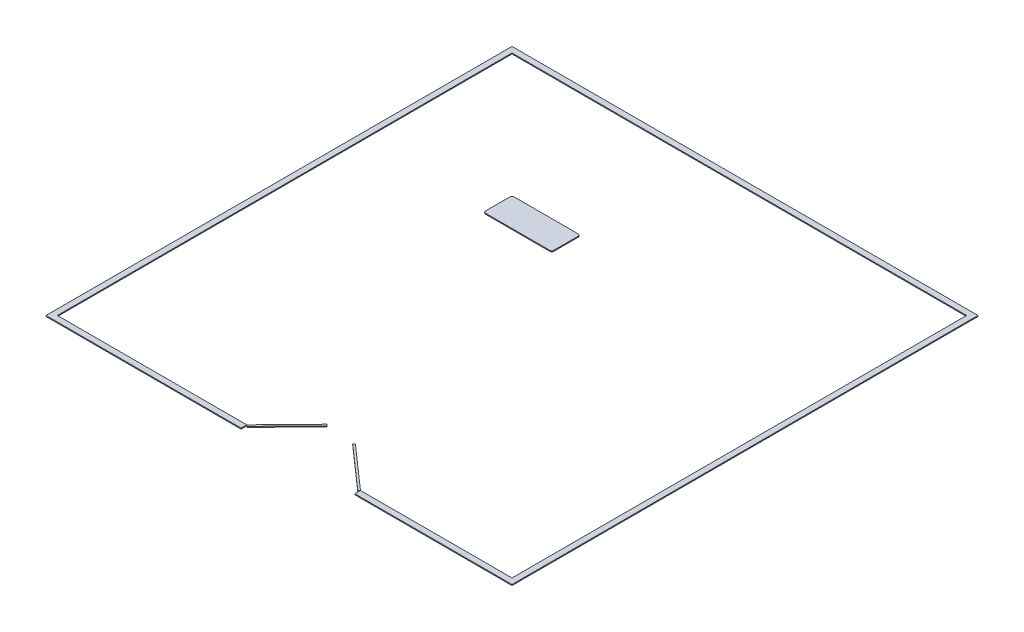
ISO-10303-21;
HEADER;
FILE_DESCRIPTION(('STEP AP214'),'2;1');
FILE_NAME('part.step','',(''),(''),'','','');
FILE_SCHEMA(('AUTOMOTIVE_DESIGN { 1 0 10303 214 1 1 1 1 }'));
ENDSEC;
DATA;
#1=APPLICATION_CONTEXT('core data for automotive mechanical design processes');
#2=APPLICATION_PROTOCOL_DEFINITION('international standard','automotive_design',2000,#1);
#3=PRODUCT_CONTEXT('',#1,'mechanical');
#4=PRODUCT('Part','Part','',(#3));
#5=PRODUCT_RELATED_PRODUCT_CATEGORY('part','',(#4));
#6=PRODUCT_DEFINITION_FORMATION('','',#4);
#7=PRODUCT_DEFINITION_CONTEXT('part definition',#1,'design');
#8=PRODUCT_DEFINITION('design','',#6,#7);
#9=PRODUCT_DEFINITION_SHAPE('','',#8);
#10=(LENGTH_UNIT() NAMED_UNIT(*) SI_UNIT(.MILLI.,.METRE.));
#11=(NAMED_UNIT(*) PLANE_ANGLE_UNIT() SI_UNIT($,.RADIAN.));
#12=(NAMED_UNIT(*) SI_UNIT($,.STERADIAN.) SOLID_ANGLE_UNIT());
#13=UNCERTAINTY_MEASURE_WITH_UNIT(LENGTH_MEASURE(1.E-05),#10,'distance_accuracy_value','');
#14=(GEOMETRIC_REPRESENTATION_CONTEXT(3) GLOBAL_UNCERTAINTY_ASSIGNED_CONTEXT((#13)) GLOBAL_UNIT_ASSIGNED_CONTEXT((#10,
#11,#12)) REPRESENTATION_CONTEXT('',''));
#15=CARTESIAN_POINT('',(0.,0.,0.));
#16=DIRECTION('',(0.,0.,1.));
#17=DIRECTION('',(1.,0.,0.));
#18=AXIS2_PLACEMENT_3D('',#15,#16,#17);
#19=CARTESIAN_POINT('',(8091.38785926303,25.4,35.4452196999511));
#20=DIRECTION('',(-0.695564454896768,0.,-0.718463700603003));
#21=DIRECTION('',(-0.718463700603003,0.,0.695564454896768));
#22=AXIS2_PLACEMENT_3D('',#19,#20,#21);
#23=PLANE('',#22);
#24=DIRECTION('',(0.718463700603003,0.,-0.695564454896768));
#25=VECTOR('',#24,1.);
#26=CARTESIAN_POINT('',(8091.38785926303,0.,35.4452196999511));
#27=LINE('',#26,#25);
#28=CARTESIAN_POINT('',(8091.38785926303,0.,35.4452196999511));
#29=VERTEX_POINT('',#28);
#30=CARTESIAN_POINT('',(8128.,0.,0.));
#31=VERTEX_POINT('',#30);
#32=EDGE_CURVE('E112',#29,#31,#27,.T.);
#33=ORIENTED_EDGE('',*,*,#32,.T.);
#34=DIRECTION('',(0.,-1.,0.));
#35=VECTOR('',#34,1.);
#36=CARTESIAN_POINT('',(8128.,25.4,0.));
#37=LINE('',#36,#35);
#38=CARTESIAN_POINT('',(8128.,25.4,0.));
#39=VERTEX_POINT('',#38);
#40=EDGE_CURVE('E12',#39,#31,#37,.T.);
#41=ORIENTED_EDGE('',*,*,#40,.F.);
#42=DIRECTION('',(0.718463700603003,0.,-0.695564454896768));
#43=VECTOR('',#42,1.);
#44=CARTESIAN_POINT('',(8091.38785926303,25.4,35.4452196999511));
#45=LINE('',#44,#43);
#46=CARTESIAN_POINT('',(8091.38785926303,25.4,35.4452196999511));
#47=VERTEX_POINT('',#46);
#48=EDGE_CURVE('E100',#47,#39,#45,.T.);
#49=ORIENTED_EDGE('',*,*,#48,.F.);
#50=DIRECTION('',(0.,-1.,0.));
#51=VECTOR('',#50,1.);
#52=CARTESIAN_POINT('',(8091.38785926303,25.4,35.4452196999511));
#53=LINE('',#52,#51);
#54=EDGE_CURVE('E108',#47,#29,#53,.T.);
#55=ORIENTED_EDGE('',*,*,#54,.T.);
#56=EDGE_LOOP('',(#33,#41,#49,#55));
#57=FACE_BOUND('',#56,.T.);
#58=ADVANCED_FACE('F49',(#57),#23,.F.);
#59=CARTESIAN_POINT('',(8128.,25.4,0.));
#60=DIRECTION('',(-0.661331494257193,0.,0.750093763941248));
#61=DIRECTION('',(0.750093763941248,0.,0.661331494257193));
#62=AXIS2_PLACEMENT_3D('',#59,#60,#61);
#63=PLANE('',#62);
#64=DIRECTION('',(-0.750093763941248,0.,-0.661331494257193));
#65=VECTOR('',#64,1.);
#66=CARTESIAN_POINT('',(8128.,0.,0.));
#67=LINE('',#66,#65);
#68=CARTESIAN_POINT('',(6984.85710375354,0.,-1007.86919724796));
#69=VERTEX_POINT('',#68);
#70=EDGE_CURVE('E104',#31,#69,#67,.T.);
#71=ORIENTED_EDGE('',*,*,#70,.T.);
#72=DIRECTION('',(0.,-1.,0.));
#73=VECTOR('',#72,1.);
#74=CARTESIAN_POINT('',(6984.85710375354,25.4,-1007.86919724796));
#75=LINE('',#74,#73);
#76=CARTESIAN_POINT('',(6984.85710375354,25.4,-1007.86919724796));
#77=VERTEX_POINT('',#76);
#78=EDGE_CURVE('E57',#77,#69,#75,.T.);
#79=ORIENTED_EDGE('',*,*,#78,.F.);
#80=DIRECTION('',(-0.750093763941248,0.,-0.661331494257193));
#81=VECTOR('',#80,1.);
#82=CARTESIAN_POINT('',(8128.,25.4,0.));
#83=LINE('',#82,#81);
#84=EDGE_CURVE('E95',#39,#77,#83,.T.);
#85=ORIENTED_EDGE('',*,*,#84,.F.);
#86=ORIENTED_EDGE('',*,*,#40,.T.);
#87=EDGE_LOOP('',(#71,#79,#85,#86));
#88=FACE_BOUND('',#87,.T.);
#89=ADVANCED_FACE('F103',(#88),#63,.F.);
#90=CARTESIAN_POINT('',(6984.85710375354,25.4,-1007.86919724796));
#91=DIRECTION('',(0.75009376394125,0.,0.66133149425719));
#92=DIRECTION('',(0.66133149425719,0.,-0.75009376394125));
#93=AXIS2_PLACEMENT_3D('',#90,#91,#92);
#94=PLANE('',#93);
#95=DIRECTION('',(-0.66133149425719,0.,0.75009376394125));
#96=VECTOR('',#95,1.);
#97=CARTESIAN_POINT('',(6984.85710375354,0.,-1007.86919724796));
#98=LINE('',#97,#96);
#99=CARTESIAN_POINT('',(6951.26146384527,0.,-969.764434039747));
#100=VERTEX_POINT('',#99);
#101=EDGE_CURVE('E82',#69,#100,#98,.T.);
#102=ORIENTED_EDGE('',*,*,#101,.T.);
#103=DIRECTION('',(0.,-1.,0.));
#104=VECTOR('',#103,1.);
#105=CARTESIAN_POINT('',(6951.26146384527,25.4,-969.764434039747));
#106=LINE('',#105,#104);
#107=CARTESIAN_POINT('',(6951.26146384527,25.4,-969.764434039747));
#108=VERTEX_POINT('',#107);
#109=EDGE_CURVE('E105',#108,#100,#106,.T.);
#110=ORIENTED_EDGE('',*,*,#109,.F.);
#111=DIRECTION('',(-0.66133149425719,0.,0.75009376394125));
#112=VECTOR('',#111,1.);
#113=CARTESIAN_POINT('',(6984.85710375354,25.4,-1007.86919724796));
#114=LINE('',#113,#112);
#115=EDGE_CURVE('E98',#77,#108,#114,.T.);
#116=ORIENTED_EDGE('',*,*,#115,.F.);
#117=ORIENTED_EDGE('',*,*,#78,.T.);
#118=EDGE_LOOP('',(#102,#110,#116,#117));
#119=FACE_BOUND('',#118,.T.);
#120=ADVANCED_FACE('F106',(#119),#94,.F.);
#121=CARTESIAN_POINT('',(6951.26146384527,25.4,-969.764434039747));
#122=DIRECTION('',(0.66133149425719,0.,-0.75009376394125));
#123=DIRECTION('',(-0.75009376394125,0.,-0.66133149425719));
#124=AXIS2_PLACEMENT_3D('',#121,#122,#123);
#125=PLANE('',#124);
#126=DIRECTION('',(0.75009376394125,0.,0.66133149425719));
#127=VECTOR('',#126,1.);
#128=CARTESIAN_POINT('',(6951.26146384527,0.,-969.764434039747));
#129=LINE('',#128,#127);
#130=EDGE_CURVE('E88',#100,#29,#129,.T.);
#131=ORIENTED_EDGE('',*,*,#130,.T.);
#132=ORIENTED_EDGE('',*,*,#54,.F.);
#133=DIRECTION('',(0.75009376394125,0.,0.66133149425719));
#134=VECTOR('',#133,1.);
#135=CARTESIAN_POINT('',(6951.26146384527,25.4,-969.764434039747));
#136=LINE('',#135,#134);
#137=EDGE_CURVE('E65',#108,#47,#136,.T.);
#138=ORIENTED_EDGE('',*,*,#137,.F.);
#139=ORIENTED_EDGE('',*,*,#109,.T.);
#140=EDGE_LOOP('',(#131,#132,#138,#139));
#141=FACE_BOUND('',#140,.T.);
#142=ADVANCED_FACE('F119',(#141),#125,.F.);
#143=CARTESIAN_POINT('',(0.,25.4,0.));
#144=DIRECTION('',(0.,1.,0.));
#145=DIRECTION('',(0.,0.,1.));
#146=AXIS2_PLACEMENT_3D('',#143,#144,#145);
#147=PLANE('',#146);
#148=ORIENTED_EDGE('',*,*,#48,.T.);
#149=ORIENTED_EDGE('',*,*,#84,.T.);
#150=ORIENTED_EDGE('',*,*,#115,.T.);
#151=ORIENTED_EDGE('',*,*,#137,.T.);
#152=EDGE_LOOP('',(#148,#149,#150,#151));
#153=FACE_BOUND('',#152,.T.);
#154=ADVANCED_FACE('F96',(#153),#147,.T.);
#155=CARTESIAN_POINT('',(0.,0.,0.));
#156=DIRECTION('',(0.,1.,0.));
#157=DIRECTION('',(0.,0.,1.));
#158=AXIS2_PLACEMENT_3D('',#155,#156,#157);
#159=PLANE('',#158);
#160=ORIENTED_EDGE('',*,*,#32,.F.);
#161=ORIENTED_EDGE('',*,*,#130,.F.);
#162=ORIENTED_EDGE('',*,*,#101,.F.);
#163=ORIENTED_EDGE('',*,*,#70,.F.);
#164=EDGE_LOOP('',(#160,#161,#162,#163));
#165=FACE_BOUND('',#164,.T.);
#166=ADVANCED_FACE('F122',(#165),#159,.F.);
#167=CLOSED_SHELL('',(#58,#89,#120,#142,#154,#166));
#168=MANIFOLD_SOLID_BREP('B2',#167);
#169=CARTESIAN_POINT('',(5116.39060868441,25.4,35.4452196999511));
#170=DIRECTION('',(0.697740545274679,0.,-0.716350564653783));
#171=DIRECTION('',(-0.716350564653783,0.,-0.697740545274679));
#172=AXIS2_PLACEMENT_3D('',#169,#170,#171);
#173=PLANE('',#172);
#174=DIRECTION('',(0.716350564653783,0.,0.697740545274679));
#175=VECTOR('',#174,1.);
#176=CARTESIAN_POINT('',(5116.39060868441,0.,35.4452196999511));
#177=LINE('',#176,#175);
#178=CARTESIAN_POINT('',(5080.,0.,0.));
#179=VERTEX_POINT('',#178);
#180=CARTESIAN_POINT('',(5116.39060868441,0.,35.4452196999511));
#181=VERTEX_POINT('',#180);
#182=EDGE_CURVE('E245',#179,#181,#177,.T.);
#183=ORIENTED_EDGE('',*,*,#182,.T.);
#184=DIRECTION('',(0.,-1.,0.));
#185=VECTOR('',#184,1.);
#186=CARTESIAN_POINT('',(5116.39060868441,25.4,35.4452196999511));
#187=LINE('',#186,#185);
#188=CARTESIAN_POINT('',(5116.39060868441,25.4,35.4452196999511));
#189=VERTEX_POINT('',#188);
#190=EDGE_CURVE('E47',#189,#181,#187,.T.);
#191=ORIENTED_EDGE('',*,*,#190,.F.);
#192=DIRECTION('',(0.716350564653783,0.,0.697740545274679));
#193=VECTOR('',#192,1.);
#194=CARTESIAN_POINT('',(5116.39060868441,25.4,35.4452196999511));
#195=LINE('',#194,#193);
#196=CARTESIAN_POINT('',(5080.,25.4,0.));
#197=VERTEX_POINT('',#196);
#198=EDGE_CURVE('E233',#197,#189,#195,.T.);
#199=ORIENTED_EDGE('',*,*,#198,.F.);
#200=DIRECTION('',(0.,-1.,0.));
#201=VECTOR('',#200,1.);
#202=CARTESIAN_POINT('',(5080.,25.4,0.));
#203=LINE('',#202,#201);
#204=EDGE_CURVE('E241',#197,#179,#203,.T.);
#205=ORIENTED_EDGE('',*,*,#204,.T.);
#206=EDGE_LOOP('',(#183,#191,#199,#205));
#207=FACE_BOUND('',#206,.T.);
#208=ADVANCED_FACE('F182',(#207),#173,.F.);
#209=CARTESIAN_POINT('',(6179.74719968301,25.4,-1056.27304083242));
#210=DIRECTION('',(-0.716350564653786,0.,-0.697740545274675));
#211=DIRECTION('',(-0.697740545274676,0.,0.716350564653786));
#212=AXIS2_PLACEMENT_3D('',#209,#210,#211);
#213=PLANE('',#212);
#214=DIRECTION('',(0.697740545274675,0.,-0.716350564653786));
#215=VECTOR('',#214,1.);
#216=CARTESIAN_POINT('',(6179.74719968301,0.,-1056.27304083242));
#217=LINE('',#216,#215);
#218=CARTESIAN_POINT('',(6179.74719968301,0.,-1056.27304083242));
#219=VERTEX_POINT('',#218);
#220=EDGE_CURVE('E237',#181,#219,#217,.T.);
#221=ORIENTED_EDGE('',*,*,#220,.T.);
#222=DIRECTION('',(0.,-1.,0.));
#223=VECTOR('',#222,1.);
#224=CARTESIAN_POINT('',(6179.74719968301,25.4,-1056.27304083242));
#225=LINE('',#224,#223);
#226=CARTESIAN_POINT('',(6179.74719968301,25.4,-1056.27304083242));
#227=VERTEX_POINT('',#226);
#228=EDGE_CURVE('E190',#227,#219,#225,.T.);
#229=ORIENTED_EDGE('',*,*,#228,.F.);
#230=DIRECTION('',(0.697740545274675,0.,-0.716350564653786));
#231=VECTOR('',#230,1.);
#232=CARTESIAN_POINT('',(6179.74719968301,25.4,-1056.27304083242));
#233=LINE('',#232,#231);
#234=EDGE_CURVE('E228',#189,#227,#233,.T.);
#235=ORIENTED_EDGE('',*,*,#234,.F.);
#236=ORIENTED_EDGE('',*,*,#190,.T.);
#237=EDGE_LOOP('',(#221,#229,#235,#236));
#238=FACE_BOUND('',#237,.T.);
#239=ADVANCED_FACE('F236',(#238),#213,.F.);
#240=CARTESIAN_POINT('',(6143.3565909986,25.4,-1091.71826053237));
#241=DIRECTION('',(-0.69774054527468,0.,0.716350564653782));
#242=DIRECTION('',(0.716350564653782,0.,0.69774054527468));
#243=AXIS2_PLACEMENT_3D('',#240,#241,#242);
#244=PLANE('',#243);
#245=DIRECTION('',(-0.716350564653782,0.,-0.69774054527468));
#246=VECTOR('',#245,1.);
#247=CARTESIAN_POINT('',(6143.3565909986,0.,-1091.71826053237));
#248=LINE('',#247,#246);
#249=CARTESIAN_POINT('',(6143.3565909986,0.,-1091.71826053237));
#250=VERTEX_POINT('',#249);
#251=EDGE_CURVE('E215',#219,#250,#248,.T.);
#252=ORIENTED_EDGE('',*,*,#251,.T.);
#253=DIRECTION('',(0.,-1.,0.));
#254=VECTOR('',#253,1.);
#255=CARTESIAN_POINT('',(6143.3565909986,25.4,-1091.71826053237));
#256=LINE('',#255,#254);
#257=CARTESIAN_POINT('',(6143.3565909986,25.4,-1091.71826053237));
#258=VERTEX_POINT('',#257);
#259=EDGE_CURVE('E238',#258,#250,#256,.T.);
#260=ORIENTED_EDGE('',*,*,#259,.F.);
#261=DIRECTION('',(-0.716350564653782,0.,-0.69774054527468));
#262=VECTOR('',#261,1.);
#263=CARTESIAN_POINT('',(6143.3565909986,25.4,-1091.71826053237));
#264=LINE('',#263,#262);
#265=EDGE_CURVE('E231',#227,#258,#264,.T.);
#266=ORIENTED_EDGE('',*,*,#265,.F.);
#267=ORIENTED_EDGE('',*,*,#228,.T.);
#268=EDGE_LOOP('',(#252,#260,#266,#267));
#269=FACE_BOUND('',#268,.T.);
#270=ADVANCED_FACE('F239',(#269),#244,.F.);
#271=CARTESIAN_POINT('',(5080.,25.4,0.));
#272=DIRECTION('',(0.716350564653788,0.,0.697740545274674));
#273=DIRECTION('',(0.697740545274674,0.,-0.716350564653788));
#274=AXIS2_PLACEMENT_3D('',#271,#272,#273);
#275=PLANE('',#274);
#276=DIRECTION('',(-0.697740545274674,0.,0.716350564653788));
#277=VECTOR('',#276,1.);
#278=CARTESIAN_POINT('',(5080.,0.,0.));
#279=LINE('',#278,#277);
#280=EDGE_CURVE('E221',#250,#179,#279,.T.);
#281=ORIENTED_EDGE('',*,*,#280,.T.);
#282=ORIENTED_EDGE('',*,*,#204,.F.);
#283=DIRECTION('',(-0.697740545274674,0.,0.716350564653788));
#284=VECTOR('',#283,1.);
#285=CARTESIAN_POINT('',(5080.,25.4,0.));
#286=LINE('',#285,#284);
#287=EDGE_CURVE('E198',#258,#197,#286,.T.);
#288=ORIENTED_EDGE('',*,*,#287,.F.);
#289=ORIENTED_EDGE('',*,*,#259,.T.);
#290=EDGE_LOOP('',(#281,#282,#288,#289));
#291=FACE_BOUND('',#290,.T.);
#292=ADVANCED_FACE('F252',(#291),#275,.F.);
#293=CARTESIAN_POINT('',(0.,25.4,0.));
#294=DIRECTION('',(0.,-1.,0.));
#295=DIRECTION('',(0.,0.,-1.));
#296=AXIS2_PLACEMENT_3D('',#293,#294,#295);
#297=PLANE('',#296);
#298=ORIENTED_EDGE('',*,*,#198,.T.);
#299=ORIENTED_EDGE('',*,*,#234,.T.);
#300=ORIENTED_EDGE('',*,*,#265,.T.);
#301=ORIENTED_EDGE('',*,*,#287,.T.);
#302=EDGE_LOOP('',(#298,#299,#300,#301));
#303=FACE_BOUND('',#302,.T.);
#304=ADVANCED_FACE('F229',(#303),#297,.F.);
#305=CARTESIAN_POINT('',(0.,0.,0.));
#306=DIRECTION('',(0.,-1.,0.));
#307=DIRECTION('',(0.,0.,-1.));
#308=AXIS2_PLACEMENT_3D('',#305,#306,#307);
#309=PLANE('',#308);
#310=ORIENTED_EDGE('',*,*,#182,.F.);
#311=ORIENTED_EDGE('',*,*,#280,.F.);
#312=ORIENTED_EDGE('',*,*,#251,.F.);
#313=ORIENTED_EDGE('',*,*,#220,.F.);
#314=EDGE_LOOP('',(#310,#311,#312,#313));
#315=FACE_BOUND('',#314,.T.);
#316=ADVANCED_FACE('F255',(#315),#309,.T.);
#317=CLOSED_SHELL('',(#208,#239,#270,#292,#304,#316));
#318=MANIFOLD_SOLID_BREP('B6',#317);
#319=CARTESIAN_POINT('',(5092.25506006705,25.4,-8166.45950436732));
#320=DIRECTION('',(0.,-1.,0.));
#321=DIRECTION('',(0.,0.,-1.));
#322=AXIS2_PLACEMENT_3D('',#319,#320,#321);
#323=CYLINDRICAL_SURFACE('',#322,50.8000000000002);
#324=CARTESIAN_POINT('',(5092.25506006705,0.,-8166.45950436732));
#325=DIRECTION('',(0.,1.,0.));
#326=DIRECTION('',(0.,0.,1.));
#327=AXIS2_PLACEMENT_3D('',#324,#325,#326);
#328=CIRCLE('',#327,50.8000000000002);
#329=CARTESIAN_POINT('',(5092.25506006705,0.,-8115.65950436732));
#330=VERTEX_POINT('',#329);
#331=CARTESIAN_POINT('',(5143.05506006705,0.,-8166.45950436732));
#332=VERTEX_POINT('',#331);
#333=EDGE_CURVE('E410',#330,#332,#328,.T.);
#334=ORIENTED_EDGE('',*,*,#333,.T.);
#335=DIRECTION('',(0.,-1.,0.));
#336=VECTOR('',#335,1.);
#337=CARTESIAN_POINT('',(5143.05506006705,25.4,-8166.45950436732));
#338=LINE('',#337,#336);
#339=CARTESIAN_POINT('',(5143.05506006705,25.4,-8166.45950436732));
#340=VERTEX_POINT('',#339);
#341=EDGE_CURVE('E180',#340,#332,#338,.T.);
#342=ORIENTED_EDGE('',*,*,#341,.F.);
#343=CARTESIAN_POINT('',(5092.25506006705,25.4,-8166.45950436732));
#344=DIRECTION('',(0.,1.,0.));
#345=DIRECTION('',(0.,0.,1.));
#346=AXIS2_PLACEMENT_3D('',#343,#344,#345);
#347=CIRCLE('',#346,50.8000000000002);
#348=CARTESIAN_POINT('',(5092.25506006705,25.4,-8115.65950436732));
#349=VERTEX_POINT('',#348);
#350=EDGE_CURVE('E424',#349,#340,#347,.T.);
#351=ORIENTED_EDGE('',*,*,#350,.F.);
#352=DIRECTION('',(0.,-1.,0.));
#353=VECTOR('',#352,1.);
#354=CARTESIAN_POINT('',(5092.25506006705,25.4,-8115.65950436732));
#355=LINE('',#354,#353);
#356=EDGE_CURVE('E406',#349,#330,#355,.T.);
#357=ORIENTED_EDGE('',*,*,#356,.T.);
#358=EDGE_LOOP('',(#334,#342,#351,#357));
#359=FACE_BOUND('',#358,.T.);
#360=ADVANCED_FACE('F314',(#359),#323,.T.);
#361=CARTESIAN_POINT('',(5143.05506006705,25.4,-8826.85950436732));
#362=DIRECTION('',(-1.,0.,0.));
#363=DIRECTION('',(0.,0.,1.));
#364=AXIS2_PLACEMENT_3D('',#361,#362,#363);
#365=PLANE('',#364);
#366=DIRECTION('',(0.,0.,-1.));
#367=VECTOR('',#366,1.);
#368=CARTESIAN_POINT('',(5143.05506006705,0.,-8826.85950436732));
#369=LINE('',#368,#367);
#370=CARTESIAN_POINT('',(5143.05506006705,0.,-8826.85950436732));
#371=VERTEX_POINT('',#370);
#372=EDGE_CURVE('E413',#332,#371,#369,.T.);
#373=ORIENTED_EDGE('',*,*,#372,.T.);
#374=DIRECTION('',(0.,-1.,0.));
#375=VECTOR('',#374,1.);
#376=CARTESIAN_POINT('',(5143.05506006705,25.4,-8826.85950436732));
#377=LINE('',#376,#375);
#378=CARTESIAN_POINT('',(5143.05506006705,25.4,-8826.85950436732));
#379=VERTEX_POINT('',#378);
#380=EDGE_CURVE('E322',#379,#371,#377,.T.);
#381=ORIENTED_EDGE('',*,*,#380,.F.);
#382=DIRECTION('',(0.,0.,-1.));
#383=VECTOR('',#382,1.);
#384=CARTESIAN_POINT('',(5143.05506006705,25.4,-8826.85950436732));
#385=LINE('',#384,#383);
#386=EDGE_CURVE('E373',#340,#379,#385,.T.);
#387=ORIENTED_EDGE('',*,*,#386,.F.);
#388=ORIENTED_EDGE('',*,*,#341,.T.);
#389=EDGE_LOOP('',(#373,#381,#387,#388));
#390=FACE_BOUND('',#389,.T.);
#391=ADVANCED_FACE('F459',(#390),#365,.F.);
#392=CARTESIAN_POINT('',(5092.25506006705,25.4,-8826.85950436732));
#393=DIRECTION('',(0.,-1.,0.));
#394=DIRECTION('',(0.,0.,-1.));
#395=AXIS2_PLACEMENT_3D('',#392,#393,#394);
#396=CYLINDRICAL_SURFACE('',#395,50.8000000000002);
#397=CARTESIAN_POINT('',(5092.25506006705,0.,-8826.85950436732));
#398=DIRECTION('',(0.,1.,0.));
#399=DIRECTION('',(0.,0.,-1.));
#400=AXIS2_PLACEMENT_3D('',#397,#398,#399);
#401=CIRCLE('',#400,50.8000000000002);
#402=CARTESIAN_POINT('',(5092.25506006705,0.,-8877.65950436732));
#403=VERTEX_POINT('',#402);
#404=EDGE_CURVE('E415',#371,#403,#401,.T.);
#405=ORIENTED_EDGE('',*,*,#404,.T.);
#406=DIRECTION('',(0.,-1.,0.));
#407=VECTOR('',#406,1.);
#408=CARTESIAN_POINT('',(5092.25506006705,25.4,-8877.65950436732));
#409=LINE('',#408,#407);
#410=CARTESIAN_POINT('',(5092.25506006705,25.4,-8877.65950436732));
#411=VERTEX_POINT('',#410);
#412=EDGE_CURVE('E431',#411,#403,#409,.T.);
#413=ORIENTED_EDGE('',*,*,#412,.F.);
#414=CARTESIAN_POINT('',(5092.25506006705,25.4,-8826.85950436732));
#415=DIRECTION('',(0.,1.,0.));
#416=DIRECTION('',(0.,0.,-1.));
#417=AXIS2_PLACEMENT_3D('',#414,#415,#416);
#418=CIRCLE('',#417,50.8000000000002);
#419=EDGE_CURVE('E439',#379,#411,#418,.T.);
#420=ORIENTED_EDGE('',*,*,#419,.F.);
#421=ORIENTED_EDGE('',*,*,#380,.T.);
#422=EDGE_LOOP('',(#405,#413,#420,#421));
#423=FACE_BOUND('',#422,.T.);
#424=ADVANCED_FACE('F437',(#423),#396,.T.);
#425=CARTESIAN_POINT('',(3365.05506006705,25.4,-8877.65950436732));
#426=DIRECTION('',(0.,0.,1.));
#427=DIRECTION('',(1.,0.,0.));
#428=AXIS2_PLACEMENT_3D('',#425,#426,#427);
#429=PLANE('',#428);
#430=DIRECTION('',(-1.,0.,0.));
#431=VECTOR('',#430,1.);
#432=CARTESIAN_POINT('',(3365.05506006705,0.,-8877.65950436732));
#433=LINE('',#432,#431);
#434=CARTESIAN_POINT('',(3365.05506006705,0.,-8877.65950436732));
#435=VERTEX_POINT('',#434);
#436=EDGE_CURVE('E417',#403,#435,#433,.T.);
#437=ORIENTED_EDGE('',*,*,#436,.T.);
#438=DIRECTION('',(0.,-1.,0.));
#439=VECTOR('',#438,1.);
#440=CARTESIAN_POINT('',(3365.05506006705,25.4,-8877.65950436732));
#441=LINE('',#440,#439);
#442=CARTESIAN_POINT('',(3365.05506006705,25.4,-8877.65950436732));
#443=VERTEX_POINT('',#442);
#444=EDGE_CURVE('E428',#443,#435,#441,.T.);
#445=ORIENTED_EDGE('',*,*,#444,.F.);
#446=DIRECTION('',(-1.,0.,0.));
#447=VECTOR('',#446,1.);
#448=CARTESIAN_POINT('',(3365.05506006705,25.4,-8877.65950436732));
#449=LINE('',#448,#447);
#450=EDGE_CURVE('E451',#411,#443,#449,.T.);
#451=ORIENTED_EDGE('',*,*,#450,.F.);
#452=ORIENTED_EDGE('',*,*,#412,.T.);
#453=EDGE_LOOP('',(#437,#445,#451,#452));
#454=FACE_BOUND('',#453,.T.);
#455=ADVANCED_FACE('F447',(#454),#429,.F.);
#456=CARTESIAN_POINT('',(3365.05506006705,25.4,-8826.85950436732));
#457=DIRECTION('',(0.,-1.,0.));
#458=DIRECTION('',(0.,0.,-1.));
#459=AXIS2_PLACEMENT_3D('',#456,#457,#458);
#460=CYLINDRICAL_SURFACE('',#459,50.8000000000004);
#461=CARTESIAN_POINT('',(3365.05506006705,0.,-8826.85950436732));
#462=DIRECTION('',(0.,1.,0.));
#463=DIRECTION('',(0.,0.,1.));
#464=AXIS2_PLACEMENT_3D('',#461,#462,#463);
#465=CIRCLE('',#464,50.8000000000004);
#466=CARTESIAN_POINT('',(3314.25506006705,0.,-8826.85950436732));
#467=VERTEX_POINT('',#466);
#468=EDGE_CURVE('E419',#435,#467,#465,.T.);
#469=ORIENTED_EDGE('',*,*,#468,.T.);
#470=DIRECTION('',(0.,-1.,0.));
#471=VECTOR('',#470,1.);
#472=CARTESIAN_POINT('',(3314.25506006705,25.4,-8826.85950436732));
#473=LINE('',#472,#471);
#474=CARTESIAN_POINT('',(3314.25506006705,25.4,-8826.85950436732));
#475=VERTEX_POINT('',#474);
#476=EDGE_CURVE('E401',#475,#467,#473,.T.);
#477=ORIENTED_EDGE('',*,*,#476,.F.);
#478=CARTESIAN_POINT('',(3365.05506006705,25.4,-8826.85950436732));
#479=DIRECTION('',(0.,1.,0.));
#480=DIRECTION('',(0.,0.,1.));
#481=AXIS2_PLACEMENT_3D('',#478,#479,#480);
#482=CIRCLE('',#481,50.8000000000004);
#483=EDGE_CURVE('E392',#443,#475,#482,.T.);
#484=ORIENTED_EDGE('',*,*,#483,.F.);
#485=ORIENTED_EDGE('',*,*,#444,.T.);
#486=EDGE_LOOP('',(#469,#477,#484,#485));
#487=FACE_BOUND('',#486,.T.);
#488=ADVANCED_FACE('F450',(#487),#460,.T.);
#489=CARTESIAN_POINT('',(3314.25506006705,25.4,-8826.85950436732));
#490=DIRECTION('',(1.,0.,0.));
#491=DIRECTION('',(0.,0.,-1.));
#492=AXIS2_PLACEMENT_3D('',#489,#490,#491);
#493=PLANE('',#492);
#494=DIRECTION('',(0.,0.,1.));
#495=VECTOR('',#494,1.);
#496=CARTESIAN_POINT('',(3314.25506006705,0.,-8826.85950436732));
#497=LINE('',#496,#495);
#498=CARTESIAN_POINT('',(3314.25506006705,0.,-8166.45950436732));
#499=VERTEX_POINT('',#498);
#500=EDGE_CURVE('E400',#467,#499,#497,.T.);
#501=ORIENTED_EDGE('',*,*,#500,.T.);
#502=DIRECTION('',(0.,-1.,0.));
#503=VECTOR('',#502,1.);
#504=CARTESIAN_POINT('',(3314.25506006705,25.4,-8166.45950436732));
#505=LINE('',#504,#503);
#506=CARTESIAN_POINT('',(3314.25506006705,25.4,-8166.45950436732));
#507=VERTEX_POINT('',#506);
#508=EDGE_CURVE('E397',#507,#499,#505,.T.);
#509=ORIENTED_EDGE('',*,*,#508,.F.);
#510=DIRECTION('',(0.,0.,1.));
#511=VECTOR('',#510,1.);
#512=CARTESIAN_POINT('',(3314.25506006705,25.4,-8826.85950436732));
#513=LINE('',#512,#511);
#514=EDGE_CURVE('E386',#475,#507,#513,.T.);
#515=ORIENTED_EDGE('',*,*,#514,.F.);
#516=ORIENTED_EDGE('',*,*,#476,.T.);
#517=EDGE_LOOP('',(#501,#509,#515,#516));
#518=FACE_BOUND('',#517,.T.);
#519=ADVANCED_FACE('F398',(#518),#493,.F.);
#520=CARTESIAN_POINT('',(3365.05506006705,25.4,-8166.45950436732));
#521=DIRECTION('',(0.,-1.,0.));
#522=DIRECTION('',(0.,0.,-1.));
#523=AXIS2_PLACEMENT_3D('',#520,#521,#522);
#524=CYLINDRICAL_SURFACE('',#523,50.8000000000004);
#525=CARTESIAN_POINT('',(3365.05506006705,0.,-8166.45950436732));
#526=DIRECTION('',(0.,1.,0.));
#527=DIRECTION('',(0.,0.,1.));
#528=AXIS2_PLACEMENT_3D('',#525,#526,#527);
#529=CIRCLE('',#528,50.8000000000004);
#530=CARTESIAN_POINT('',(3365.05506006705,0.,-8115.65950436732));
#531=VERTEX_POINT('',#530);
#532=EDGE_CURVE('E359',#499,#531,#529,.T.);
#533=ORIENTED_EDGE('',*,*,#532,.T.);
#534=DIRECTION('',(0.,-1.,0.));
#535=VECTOR('',#534,1.);
#536=CARTESIAN_POINT('',(3365.05506006705,25.4,-8115.65950436732));
#537=LINE('',#536,#535);
#538=CARTESIAN_POINT('',(3365.05506006705,25.4,-8115.65950436732));
#539=VERTEX_POINT('',#538);
#540=EDGE_CURVE('E402',#539,#531,#537,.T.);
#541=ORIENTED_EDGE('',*,*,#540,.F.);
#542=CARTESIAN_POINT('',(3365.05506006705,25.4,-8166.45950436732));
#543=DIRECTION('',(0.,1.,0.));
#544=DIRECTION('',(0.,0.,1.));
#545=AXIS2_PLACEMENT_3D('',#542,#543,#544);
#546=CIRCLE('',#545,50.8000000000004);
#547=EDGE_CURVE('E390',#507,#539,#546,.T.);
#548=ORIENTED_EDGE('',*,*,#547,.F.);
#549=ORIENTED_EDGE('',*,*,#508,.T.);
#550=EDGE_LOOP('',(#533,#541,#548,#549));
#551=FACE_BOUND('',#550,.T.);
#552=ADVANCED_FACE('F404',(#551),#524,.T.);
#553=CARTESIAN_POINT('',(3365.05506006705,25.4,-8115.65950436732));
#554=DIRECTION('',(0.,0.,-1.));
#555=DIRECTION('',(-1.,0.,0.));
#556=AXIS2_PLACEMENT_3D('',#553,#554,#555);
#557=PLANE('',#556);
#558=DIRECTION('',(1.,0.,0.));
#559=VECTOR('',#558,1.);
#560=CARTESIAN_POINT('',(3365.05506006705,0.,-8115.65950436732));
#561=LINE('',#560,#559);
#562=EDGE_CURVE('E365',#531,#330,#561,.T.);
#563=ORIENTED_EDGE('',*,*,#562,.T.);
#564=ORIENTED_EDGE('',*,*,#356,.F.);
#565=DIRECTION('',(1.,0.,0.));
#566=VECTOR('',#565,1.);
#567=CARTESIAN_POINT('',(3365.05506006705,25.4,-8115.65950436732));
#568=LINE('',#567,#566);
#569=EDGE_CURVE('E330',#539,#349,#568,.T.);
#570=ORIENTED_EDGE('',*,*,#569,.F.);
#571=ORIENTED_EDGE('',*,*,#540,.T.);
#572=EDGE_LOOP('',(#563,#564,#570,#571));
#573=FACE_BOUND('',#572,.T.);
#574=ADVANCED_FACE('F475',(#573),#557,.F.);
#575=CARTESIAN_POINT('',(5092.25506006705,25.4,-8166.45950436732));
#576=DIRECTION('',(0.,1.,0.));
#577=DIRECTION('',(0.,0.,1.));
#578=AXIS2_PLACEMENT_3D('',#575,#576,#577);
#579=PLANE('',#578);
#580=ORIENTED_EDGE('',*,*,#350,.T.);
#581=ORIENTED_EDGE('',*,*,#386,.T.);
#582=ORIENTED_EDGE('',*,*,#419,.T.);
#583=ORIENTED_EDGE('',*,*,#450,.T.);
#584=ORIENTED_EDGE('',*,*,#483,.T.);
#585=ORIENTED_EDGE('',*,*,#514,.T.);
#586=ORIENTED_EDGE('',*,*,#547,.T.);
#587=ORIENTED_EDGE('',*,*,#569,.T.);
#588=EDGE_LOOP('',(#580,#581,#582,#583,#584,#585,#586,#587));
#589=FACE_BOUND('',#588,.T.);
#590=ADVANCED_FACE('F388',(#589),#579,.T.);
#591=CARTESIAN_POINT('',(5092.25506006705,0.,-8166.45950436732));
#592=DIRECTION('',(0.,1.,0.));
#593=DIRECTION('',(0.,0.,1.));
#594=AXIS2_PLACEMENT_3D('',#591,#592,#593);
#595=PLANE('',#594);
#596=ORIENTED_EDGE('',*,*,#333,.F.);
#597=ORIENTED_EDGE('',*,*,#562,.F.);
#598=ORIENTED_EDGE('',*,*,#532,.F.);
#599=ORIENTED_EDGE('',*,*,#500,.F.);
#600=ORIENTED_EDGE('',*,*,#468,.F.);
#601=ORIENTED_EDGE('',*,*,#436,.F.);
#602=ORIENTED_EDGE('',*,*,#404,.F.);
#603=ORIENTED_EDGE('',*,*,#372,.F.);
#604=EDGE_LOOP('',(#596,#597,#598,#599,#600,#601,#602,#603));
#605=FACE_BOUND('',#604,.T.);
#606=ADVANCED_FACE('F443',(#605),#595,.F.);
#607=CLOSED_SHELL('',(#360,#391,#424,#455,#488,#519,#552,#574,#590,#606));
#608=MANIFOLD_SOLID_BREP('B41',#607);
#609=CARTESIAN_POINT('',(-152.4,25.4,152.4));
#610=DIRECTION('',(0.,0.,-1.));
#611=DIRECTION('',(-1.,0.,0.));
#612=AXIS2_PLACEMENT_3D('',#609,#610,#611);
#613=PLANE('',#612);
#614=DIRECTION('',(1.,0.,0.));
#615=VECTOR('',#614,1.);
#616=CARTESIAN_POINT('',(-152.4,25.4,152.4));
#617=LINE('',#616,#615);
#618=CARTESIAN_POINT('',(8128.,25.4,152.4));
#619=VERTEX_POINT('',#618);
#620=CARTESIAN_POINT('',(12344.4,25.4,152.4));
#621=VERTEX_POINT('',#620);
#622=EDGE_CURVE('E696',#619,#621,#617,.T.);
#623=ORIENTED_EDGE('',*,*,#622,.F.);
#624=DIRECTION('',(0.,1.,0.));
#625=VECTOR('',#624,1.);
#626=CARTESIAN_POINT('',(8128.,0.,152.4));
#627=LINE('',#626,#625);
#628=CARTESIAN_POINT('',(8128.,0.,152.4));
#629=VERTEX_POINT('',#628);
#630=EDGE_CURVE('E639',#629,#619,#627,.T.);
#631=ORIENTED_EDGE('',*,*,#630,.F.);
#632=DIRECTION('',(1.,0.,0.));
#633=VECTOR('',#632,1.);
#634=CARTESIAN_POINT('',(-152.4,0.,152.4));
#635=LINE('',#634,#633);
#636=CARTESIAN_POINT('',(12344.4,0.,152.4));
#637=VERTEX_POINT('',#636);
#638=EDGE_CURVE('E656',#629,#637,#635,.T.);
#639=ORIENTED_EDGE('',*,*,#638,.T.);
#640=DIRECTION('',(0.,-1.,0.));
#641=VECTOR('',#640,1.);
#642=CARTESIAN_POINT('',(12344.4,25.4,152.4));
#643=LINE('',#642,#641);
#644=EDGE_CURVE('E549',#621,#637,#643,.T.);
#645=ORIENTED_EDGE('',*,*,#644,.F.);
#646=EDGE_LOOP('',(#623,#631,#639,#645));
#647=FACE_BOUND('',#646,.T.);
#648=ADVANCED_FACE('F541',(#647),#613,.F.);
#649=CARTESIAN_POINT('',(0.,25.4,0.));
#650=DIRECTION('',(0.,0.,-1.));
#651=DIRECTION('',(-1.,0.,0.));
#652=AXIS2_PLACEMENT_3D('',#649,#650,#651);
#653=PLANE('',#652);
#654=DIRECTION('',(0.,1.,0.));
#655=VECTOR('',#654,1.);
#656=CARTESIAN_POINT('',(8128.,0.,0.));
#657=LINE('',#656,#655);
#658=CARTESIAN_POINT('',(8128.,0.,0.));
#659=VERTEX_POINT('',#658);
#660=CARTESIAN_POINT('',(8128.,25.4,0.));
#661=VERTEX_POINT('',#660);
#662=EDGE_CURVE('E708',#659,#661,#657,.T.);
#663=ORIENTED_EDGE('',*,*,#662,.T.);
#664=DIRECTION('',(1.,0.,0.));
#665=VECTOR('',#664,1.);
#666=CARTESIAN_POINT('',(0.,25.4,0.));
#667=LINE('',#666,#665);
#668=CARTESIAN_POINT('',(12192.,25.4,0.));
#669=VERTEX_POINT('',#668);
#670=EDGE_CURVE('E717',#661,#669,#667,.T.);
#671=ORIENTED_EDGE('',*,*,#670,.T.);
#672=DIRECTION('',(0.,-1.,0.));
#673=VECTOR('',#672,1.);
#674=CARTESIAN_POINT('',(12192.,25.4,0.));
#675=LINE('',#674,#673);
#676=CARTESIAN_POINT('',(12192.,0.,0.));
#677=VERTEX_POINT('',#676);
#678=EDGE_CURVE('E741',#669,#677,#675,.T.);
#679=ORIENTED_EDGE('',*,*,#678,.T.);
#680=DIRECTION('',(1.,0.,0.));
#681=VECTOR('',#680,1.);
#682=CARTESIAN_POINT('',(0.,0.,0.));
#683=LINE('',#682,#681);
#684=EDGE_CURVE('E730',#659,#677,#683,.T.);
#685=ORIENTED_EDGE('',*,*,#684,.F.);
#686=EDGE_LOOP('',(#663,#671,#679,#685));
#687=FACE_BOUND('',#686,.T.);
#688=ADVANCED_FACE('F766',(#687),#653,.T.);
#689=CARTESIAN_POINT('',(0.,25.4,0.));
#690=DIRECTION('',(0.,-1.,0.));
#691=DIRECTION('',(0.,0.,-1.));
#692=AXIS2_PLACEMENT_3D('',#689,#690,#691);
#693=PLANE('',#692);
#694=ORIENTED_EDGE('',*,*,#670,.F.);
#695=DIRECTION('',(0.,0.,-1.));
#696=VECTOR('',#695,1.);
#697=CARTESIAN_POINT('',(8128.,25.4,0.));
#698=LINE('',#697,#696);
#699=EDGE_CURVE('E556',#619,#661,#698,.T.);
#700=ORIENTED_EDGE('',*,*,#699,.F.);
#701=ORIENTED_EDGE('',*,*,#622,.T.);
#702=DIRECTION('',(0.,0.,-1.));
#703=VECTOR('',#702,1.);
#704=CARTESIAN_POINT('',(12344.4,25.4,152.4));
#705=LINE('',#704,#703);
#706=CARTESIAN_POINT('',(12344.4,25.4,-12344.4));
#707=VERTEX_POINT('',#706);
#708=EDGE_CURVE('E683',#621,#707,#705,.T.);
#709=ORIENTED_EDGE('',*,*,#708,.T.);
#710=DIRECTION('',(-1.,0.,0.));
#711=VECTOR('',#710,1.);
#712=CARTESIAN_POINT('',(-152.4,25.4,-12344.4));
#713=LINE('',#712,#711);
#714=CARTESIAN_POINT('',(-152.4,25.4,-12344.4));
#715=VERTEX_POINT('',#714);
#716=EDGE_CURVE('E672',#707,#715,#713,.T.);
#717=ORIENTED_EDGE('',*,*,#716,.T.);
#718=DIRECTION('',(0.,0.,1.));
#719=VECTOR('',#718,1.);
#720=CARTESIAN_POINT('',(-152.4,25.4,152.4));
#721=LINE('',#720,#719);
#722=CARTESIAN_POINT('',(-152.4,25.4,152.4));
#723=VERTEX_POINT('',#722);
#724=EDGE_CURVE('E667',#715,#723,#721,.T.);
#725=ORIENTED_EDGE('',*,*,#724,.T.);
#726=CARTESIAN_POINT('',(5080.,25.4,152.4));
#727=VERTEX_POINT('',#726);
#728=EDGE_CURVE('E698',#723,#727,#617,.T.);
#729=ORIENTED_EDGE('',*,*,#728,.T.);
#730=DIRECTION('',(0.,0.,1.));
#731=VECTOR('',#730,1.);
#732=CARTESIAN_POINT('',(5080.,25.4,0.));
#733=LINE('',#732,#731);
#734=CARTESIAN_POINT('',(5080.,25.4,0.));
#735=VERTEX_POINT('',#734);
#736=EDGE_CURVE('E635',#735,#727,#733,.T.);
#737=ORIENTED_EDGE('',*,*,#736,.F.);
#738=CARTESIAN_POINT('',(0.,25.4,0.));
#739=VERTEX_POINT('',#738);
#740=EDGE_CURVE('E719',#739,#735,#667,.T.);
#741=ORIENTED_EDGE('',*,*,#740,.F.);
#742=DIRECTION('',(0.,0.,1.));
#743=VECTOR('',#742,1.);
#744=CARTESIAN_POINT('',(0.,25.4,0.));
#745=LINE('',#744,#743);
#746=CARTESIAN_POINT('',(0.,25.4,-12192.));
#747=VERTEX_POINT('',#746);
#748=EDGE_CURVE('E715',#747,#739,#745,.T.);
#749=ORIENTED_EDGE('',*,*,#748,.F.);
#750=DIRECTION('',(-1.,0.,0.));
#751=VECTOR('',#750,1.);
#752=CARTESIAN_POINT('',(0.,25.4,-12192.));
#753=LINE('',#752,#751);
#754=CARTESIAN_POINT('',(12192.,25.4,-12192.));
#755=VERTEX_POINT('',#754);
#756=EDGE_CURVE('E726',#755,#747,#753,.T.);
#757=ORIENTED_EDGE('',*,*,#756,.F.);
#758=DIRECTION('',(0.,0.,-1.));
#759=VECTOR('',#758,1.);
#760=CARTESIAN_POINT('',(12192.,25.4,0.));
#761=LINE('',#760,#759);
#762=EDGE_CURVE('E722',#669,#755,#761,.T.);
#763=ORIENTED_EDGE('',*,*,#762,.F.);
#764=EDGE_LOOP('',(#694,#700,#701,#709,#717,#725,#729,#737,#741,#749,#757,#763));
#765=FACE_BOUND('',#764,.T.);
#766=ADVANCED_FACE('F706',(#765),#693,.F.);
#767=CARTESIAN_POINT('',(0.,0.,0.));
#768=DIRECTION('',(0.,-1.,0.));
#769=DIRECTION('',(0.,0.,-1.));
#770=AXIS2_PLACEMENT_3D('',#767,#768,#769);
#771=PLANE('',#770);
#772=DIRECTION('',(0.,0.,-1.));
#773=VECTOR('',#772,1.);
#774=CARTESIAN_POINT('',(8128.,0.,0.));
#775=LINE('',#774,#773);
#776=EDGE_CURVE('E650',#629,#659,#775,.T.);
#777=ORIENTED_EDGE('',*,*,#776,.T.);
#778=ORIENTED_EDGE('',*,*,#684,.T.);
#779=DIRECTION('',(0.,0.,-1.));
#780=VECTOR('',#779,1.);
#781=CARTESIAN_POINT('',(12192.,0.,0.));
#782=LINE('',#781,#780);
#783=CARTESIAN_POINT('',(12192.,0.,-12192.));
#784=VERTEX_POINT('',#783);
#785=EDGE_CURVE('E732',#677,#784,#782,.T.);
#786=ORIENTED_EDGE('',*,*,#785,.T.);
#787=DIRECTION('',(-1.,0.,0.));
#788=VECTOR('',#787,1.);
#789=CARTESIAN_POINT('',(0.,0.,-12192.));
#790=LINE('',#789,#788);
#791=CARTESIAN_POINT('',(0.,0.,-12192.));
#792=VERTEX_POINT('',#791);
#793=EDGE_CURVE('E718',#784,#792,#790,.T.);
#794=ORIENTED_EDGE('',*,*,#793,.T.);
#795=DIRECTION('',(0.,0.,1.));
#796=VECTOR('',#795,1.);
#797=CARTESIAN_POINT('',(0.,0.,0.));
#798=LINE('',#797,#796);
#799=CARTESIAN_POINT('',(0.,0.,0.));
#800=VERTEX_POINT('',#799);
#801=EDGE_CURVE('E710',#792,#800,#798,.T.);
#802=ORIENTED_EDGE('',*,*,#801,.T.);
#803=CARTESIAN_POINT('',(5080.,0.,0.));
#804=VERTEX_POINT('',#803);
#805=EDGE_CURVE('E649',#800,#804,#683,.T.);
#806=ORIENTED_EDGE('',*,*,#805,.T.);
#807=DIRECTION('',(0.,0.,1.));
#808=VECTOR('',#807,1.);
#809=CARTESIAN_POINT('',(5080.,0.,0.));
#810=LINE('',#809,#808);
#811=CARTESIAN_POINT('',(5080.,0.,152.4));
#812=VERTEX_POINT('',#811);
#813=EDGE_CURVE('E564',#804,#812,#810,.T.);
#814=ORIENTED_EDGE('',*,*,#813,.T.);
#815=CARTESIAN_POINT('',(-152.4,0.,152.4));
#816=VERTEX_POINT('',#815);
#817=EDGE_CURVE('E647',#816,#812,#635,.T.);
#818=ORIENTED_EDGE('',*,*,#817,.F.);
#819=DIRECTION('',(0.,0.,1.));
#820=VECTOR('',#819,1.);
#821=CARTESIAN_POINT('',(-152.4,0.,152.4));
#822=LINE('',#821,#820);
#823=CARTESIAN_POINT('',(-152.4,0.,-12344.4));
#824=VERTEX_POINT('',#823);
#825=EDGE_CURVE('E662',#824,#816,#822,.T.);
#826=ORIENTED_EDGE('',*,*,#825,.F.);
#827=DIRECTION('',(-1.,0.,0.));
#828=VECTOR('',#827,1.);
#829=CARTESIAN_POINT('',(-152.4,0.,-12344.4));
#830=LINE('',#829,#828);
#831=CARTESIAN_POINT('',(12344.4,0.,-12344.4));
#832=VERTEX_POINT('',#831);
#833=EDGE_CURVE('E659',#832,#824,#830,.T.);
#834=ORIENTED_EDGE('',*,*,#833,.F.);
#835=DIRECTION('',(0.,0.,-1.));
#836=VECTOR('',#835,1.);
#837=CARTESIAN_POINT('',(12344.4,0.,152.4));
#838=LINE('',#837,#836);
#839=EDGE_CURVE('E655',#637,#832,#838,.T.);
#840=ORIENTED_EDGE('',*,*,#839,.F.);
#841=ORIENTED_EDGE('',*,*,#638,.F.);
#842=EDGE_LOOP('',(#777,#778,#786,#794,#802,#806,#814,#818,#826,#834,#840,#841));
#843=FACE_BOUND('',#842,.T.);
#844=ADVANCED_FACE('F645',(#843),#771,.T.);
#845=CARTESIAN_POINT('',(-152.4,25.4,152.4));
#846=DIRECTION('',(1.,0.,0.));
#847=DIRECTION('',(0.,0.,-1.));
#848=AXIS2_PLACEMENT_3D('',#845,#846,#847);
#849=PLANE('',#848);
#850=ORIENTED_EDGE('',*,*,#825,.T.);
#851=DIRECTION('',(0.,-1.,0.));
#852=VECTOR('',#851,1.);
#853=CARTESIAN_POINT('',(-152.4,25.4,152.4));
#854=LINE('',#853,#852);
#855=EDGE_CURVE('E312',#723,#816,#854,.T.);
#856=ORIENTED_EDGE('',*,*,#855,.F.);
#857=ORIENTED_EDGE('',*,*,#724,.F.);
#858=DIRECTION('',(0.,-1.,0.));
#859=VECTOR('',#858,1.);
#860=CARTESIAN_POINT('',(-152.4,25.4,-12344.4));
#861=LINE('',#860,#859);
#862=EDGE_CURVE('E668',#715,#824,#861,.T.);
#863=ORIENTED_EDGE('',*,*,#862,.T.);
#864=EDGE_LOOP('',(#850,#856,#857,#863));
#865=FACE_BOUND('',#864,.T.);
#866=ADVANCED_FACE('F543',(#865),#849,.F.);
#867=ORIENTED_EDGE('',*,*,#817,.T.);
#868=DIRECTION('',(0.,1.,0.));
#869=VECTOR('',#868,1.);
#870=CARTESIAN_POINT('',(5080.,0.,152.4));
#871=LINE('',#870,#869);
#872=EDGE_CURVE('E632',#812,#727,#871,.T.);
#873=ORIENTED_EDGE('',*,*,#872,.T.);
#874=ORIENTED_EDGE('',*,*,#728,.F.);
#875=ORIENTED_EDGE('',*,*,#855,.T.);
#876=EDGE_LOOP('',(#867,#873,#874,#875));
#877=FACE_BOUND('',#876,.T.);
#878=ADVANCED_FACE('F652',(#877),#613,.F.);
#879=CARTESIAN_POINT('',(12344.4,25.4,152.4));
#880=DIRECTION('',(-1.,0.,0.));
#881=DIRECTION('',(0.,0.,1.));
#882=AXIS2_PLACEMENT_3D('',#879,#880,#881);
#883=PLANE('',#882);
#884=ORIENTED_EDGE('',*,*,#839,.T.);
#885=DIRECTION('',(0.,-1.,0.));
#886=VECTOR('',#885,1.);
#887=CARTESIAN_POINT('',(12344.4,25.4,-12344.4));
#888=LINE('',#887,#886);
#889=EDGE_CURVE('E671',#707,#832,#888,.T.);
#890=ORIENTED_EDGE('',*,*,#889,.F.);
#891=ORIENTED_EDGE('',*,*,#708,.F.);
#892=ORIENTED_EDGE('',*,*,#644,.T.);
#893=EDGE_LOOP('',(#884,#890,#891,#892));
#894=FACE_BOUND('',#893,.T.);
#895=ADVANCED_FACE('F681',(#894),#883,.F.);
#896=CARTESIAN_POINT('',(-152.4,25.4,-12344.4));
#897=DIRECTION('',(0.,0.,1.));
#898=DIRECTION('',(1.,0.,0.));
#899=AXIS2_PLACEMENT_3D('',#896,#897,#898);
#900=PLANE('',#899);
#901=ORIENTED_EDGE('',*,*,#833,.T.);
#902=ORIENTED_EDGE('',*,*,#862,.F.);
#903=ORIENTED_EDGE('',*,*,#716,.F.);
#904=ORIENTED_EDGE('',*,*,#889,.T.);
#905=EDGE_LOOP('',(#901,#902,#903,#904));
#906=FACE_BOUND('',#905,.T.);
#907=ADVANCED_FACE('F690',(#906),#900,.F.);
#908=CARTESIAN_POINT('',(0.,25.4,0.));
#909=DIRECTION('',(1.,0.,0.));
#910=DIRECTION('',(0.,0.,-1.));
#911=AXIS2_PLACEMENT_3D('',#908,#909,#910);
#912=PLANE('',#911);
#913=ORIENTED_EDGE('',*,*,#801,.F.);
#914=DIRECTION('',(0.,-1.,0.));
#915=VECTOR('',#914,1.);
#916=CARTESIAN_POINT('',(0.,25.4,-12192.));
#917=LINE('',#916,#915);
#918=EDGE_CURVE('E728',#747,#792,#917,.T.);
#919=ORIENTED_EDGE('',*,*,#918,.F.);
#920=ORIENTED_EDGE('',*,*,#748,.T.);
#921=DIRECTION('',(0.,-1.,0.));
#922=VECTOR('',#921,1.);
#923=CARTESIAN_POINT('',(0.,25.4,0.));
#924=LINE('',#923,#922);
#925=EDGE_CURVE('E701',#739,#800,#924,.T.);
#926=ORIENTED_EDGE('',*,*,#925,.T.);
#927=EDGE_LOOP('',(#913,#919,#920,#926));
#928=FACE_BOUND('',#927,.T.);
#929=ADVANCED_FACE('F752',(#928),#912,.T.);
#930=DIRECTION('',(0.,1.,0.));
#931=VECTOR('',#930,1.);
#932=CARTESIAN_POINT('',(5080.,0.,0.));
#933=LINE('',#932,#931);
#934=EDGE_CURVE('E640',#804,#735,#933,.T.);
#935=ORIENTED_EDGE('',*,*,#934,.F.);
#936=ORIENTED_EDGE('',*,*,#805,.F.);
#937=ORIENTED_EDGE('',*,*,#925,.F.);
#938=ORIENTED_EDGE('',*,*,#740,.T.);
#939=EDGE_LOOP('',(#935,#936,#937,#938));
#940=FACE_BOUND('',#939,.T.);
#941=ADVANCED_FACE('F762',(#940),#653,.T.);
#942=CARTESIAN_POINT('',(12192.,25.4,0.));
#943=DIRECTION('',(-1.,0.,0.));
#944=DIRECTION('',(0.,0.,1.));
#945=AXIS2_PLACEMENT_3D('',#942,#943,#944);
#946=PLANE('',#945);
#947=ORIENTED_EDGE('',*,*,#785,.F.);
#948=ORIENTED_EDGE('',*,*,#678,.F.);
#949=ORIENTED_EDGE('',*,*,#762,.T.);
#950=DIRECTION('',(0.,-1.,0.));
#951=VECTOR('',#950,1.);
#952=CARTESIAN_POINT('',(12192.,25.4,-12192.));
#953=LINE('',#952,#951);
#954=EDGE_CURVE('E740',#755,#784,#953,.T.);
#955=ORIENTED_EDGE('',*,*,#954,.T.);
#956=EDGE_LOOP('',(#947,#948,#949,#955));
#957=FACE_BOUND('',#956,.T.);
#958=ADVANCED_FACE('F764',(#957),#946,.T.);
#959=CARTESIAN_POINT('',(0.,25.4,-12192.));
#960=DIRECTION('',(0.,0.,1.));
#961=DIRECTION('',(1.,0.,0.));
#962=AXIS2_PLACEMENT_3D('',#959,#960,#961);
#963=PLANE('',#962);
#964=ORIENTED_EDGE('',*,*,#793,.F.);
#965=ORIENTED_EDGE('',*,*,#954,.F.);
#966=ORIENTED_EDGE('',*,*,#756,.T.);
#967=ORIENTED_EDGE('',*,*,#918,.T.);
#968=EDGE_LOOP('',(#964,#965,#966,#967));
#969=FACE_BOUND('',#968,.T.);
#970=ADVANCED_FACE('F759',(#969),#963,.T.);
#971=CARTESIAN_POINT('',(5080.,0.,0.));
#972=DIRECTION('',(-1.,0.,0.));
#973=DIRECTION('',(0.,0.,1.));
#974=AXIS2_PLACEMENT_3D('',#971,#972,#973);
#975=PLANE('',#974);
#976=ORIENTED_EDGE('',*,*,#736,.T.);
#977=ORIENTED_EDGE('',*,*,#872,.F.);
#978=ORIENTED_EDGE('',*,*,#813,.F.);
#979=ORIENTED_EDGE('',*,*,#934,.T.);
#980=EDGE_LOOP('',(#976,#977,#978,#979));
#981=FACE_BOUND('',#980,.T.);
#982=ADVANCED_FACE('F633',(#981),#975,.F.);
#983=CARTESIAN_POINT('',(8128.,0.,0.));
#984=DIRECTION('',(1.,0.,0.));
#985=DIRECTION('',(0.,0.,-1.));
#986=AXIS2_PLACEMENT_3D('',#983,#984,#985);
#987=PLANE('',#986);
#988=ORIENTED_EDGE('',*,*,#699,.T.);
#989=ORIENTED_EDGE('',*,*,#662,.F.);
#990=ORIENTED_EDGE('',*,*,#776,.F.);
#991=ORIENTED_EDGE('',*,*,#630,.T.);
#992=EDGE_LOOP('',(#988,#989,#990,#991));
#993=FACE_BOUND('',#992,.T.);
#994=ADVANCED_FACE('F855',(#993),#987,.F.);
#995=CLOSED_SHELL('',(#648,#688,#766,#844,#866,#878,#895,#907,#929,#941,#958,#970,#982,#994));
#996=MANIFOLD_SOLID_BREP('B174',#995);
#997=ADVANCED_BREP_SHAPE_REPRESENTATION('',(#18,#168,#318,#608,#996),#14);
#998=SHAPE_DEFINITION_REPRESENTATION(#9,#997);
ENDSEC;
END-ISO-10303-21;
